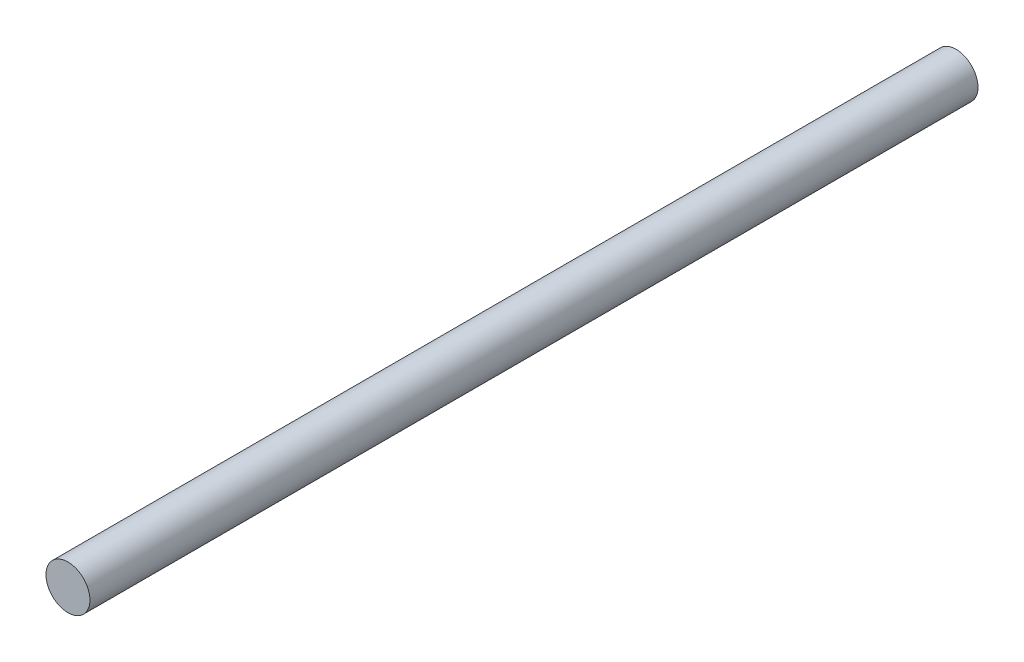
ISO-10303-21;
HEADER;
FILE_DESCRIPTION(('STEP AP214'),'2;1');
FILE_NAME('part.step','',(''),(''),'','','');
FILE_SCHEMA(('AUTOMOTIVE_DESIGN { 1 0 10303 214 1 1 1 1 }'));
ENDSEC;
DATA;
#1=APPLICATION_CONTEXT('core data for automotive mechanical design processes');
#2=APPLICATION_PROTOCOL_DEFINITION('international standard','automotive_design',2000,#1);
#3=PRODUCT_CONTEXT('',#1,'mechanical');
#4=PRODUCT('Part','Part','',(#3));
#5=PRODUCT_RELATED_PRODUCT_CATEGORY('part','',(#4));
#6=PRODUCT_DEFINITION_FORMATION('','',#4);
#7=PRODUCT_DEFINITION_CONTEXT('part definition',#1,'design');
#8=PRODUCT_DEFINITION('design','',#6,#7);
#9=PRODUCT_DEFINITION_SHAPE('','',#8);
#10=(LENGTH_UNIT() NAMED_UNIT(*) SI_UNIT(.MILLI.,.METRE.));
#11=(NAMED_UNIT(*) PLANE_ANGLE_UNIT() SI_UNIT($,.RADIAN.));
#12=(NAMED_UNIT(*) SI_UNIT($,.STERADIAN.) SOLID_ANGLE_UNIT());
#13=UNCERTAINTY_MEASURE_WITH_UNIT(LENGTH_MEASURE(1.E-05),#10,'distance_accuracy_value','');
#14=(GEOMETRIC_REPRESENTATION_CONTEXT(3) GLOBAL_UNCERTAINTY_ASSIGNED_CONTEXT((#13)) GLOBAL_UNIT_ASSIGNED_CONTEXT((#10,
#11,#12)) REPRESENTATION_CONTEXT('',''));
#15=CARTESIAN_POINT('',(0.,0.,0.));
#16=DIRECTION('',(0.,0.,1.));
#17=DIRECTION('',(1.,0.,0.));
#18=AXIS2_PLACEMENT_3D('',#15,#16,#17);
#19=CARTESIAN_POINT('',(0.,0.,1010.));
#20=DIRECTION('',(0.,0.,-1.));
#21=DIRECTION('',(-1.,0.,0.));
#22=AXIS2_PLACEMENT_3D('',#19,#20,#21);
#23=CYLINDRICAL_SURFACE('',#22,24.9999999999999);
#24=CARTESIAN_POINT('',(0.,0.,1010.));
#25=DIRECTION('',(0.,0.,1.));
#26=DIRECTION('',(1.,0.,0.));
#27=AXIS2_PLACEMENT_3D('',#24,#25,#26);
#28=CIRCLE('',#27,24.9999999999999);
#29=CARTESIAN_POINT('',(24.9999999999999,0.,1010.));
#30=VERTEX_POINT('',#29);
#31=EDGE_CURVE('E12',#30,#30,#28,.T.);
#32=ORIENTED_EDGE('',*,*,#31,.F.);
#33=EDGE_LOOP('',(#32));
#34=FACE_BOUND('',#33,.T.);
#35=CARTESIAN_POINT('',(0.,0.,0.));
#36=DIRECTION('',(0.,0.,1.));
#37=DIRECTION('',(1.,0.,0.));
#38=AXIS2_PLACEMENT_3D('',#35,#36,#37);
#39=CIRCLE('',#38,24.9999999999999);
#40=CARTESIAN_POINT('',(24.9999999999999,0.,0.));
#41=VERTEX_POINT('',#40);
#42=EDGE_CURVE('E50',#41,#41,#39,.T.);
#43=ORIENTED_EDGE('',*,*,#42,.T.);
#44=EDGE_LOOP('',(#43));
#45=FACE_BOUND('',#44,.T.);
#46=ADVANCED_FACE('F47',(#34,#45),#23,.T.);
#47=CARTESIAN_POINT('',(0.,0.,1010.));
#48=DIRECTION('',(0.,0.,1.));
#49=DIRECTION('',(1.,0.,0.));
#50=AXIS2_PLACEMENT_3D('',#47,#48,#49);
#51=PLANE('',#50);
#52=ORIENTED_EDGE('',*,*,#31,.T.);
#53=EDGE_LOOP('',(#52));
#54=FACE_BOUND('',#53,.T.);
#55=ADVANCED_FACE('F64',(#54),#51,.T.);
#56=CARTESIAN_POINT('',(0.,0.,0.));
#57=DIRECTION('',(0.,0.,1.));
#58=DIRECTION('',(1.,0.,0.));
#59=AXIS2_PLACEMENT_3D('',#56,#57,#58);
#60=PLANE('',#59);
#61=ORIENTED_EDGE('',*,*,#42,.F.);
#62=EDGE_LOOP('',(#61));
#63=FACE_BOUND('',#62,.T.);
#64=ADVANCED_FACE('F62',(#63),#60,.F.);
#65=CLOSED_SHELL('',(#46,#55,#64));
#66=MANIFOLD_SOLID_BREP('B2',#65);
#67=ADVANCED_BREP_SHAPE_REPRESENTATION('',(#18,#66),#14);
#68=SHAPE_DEFINITION_REPRESENTATION(#9,#67);
ENDSEC;
END-ISO-10303-21;
